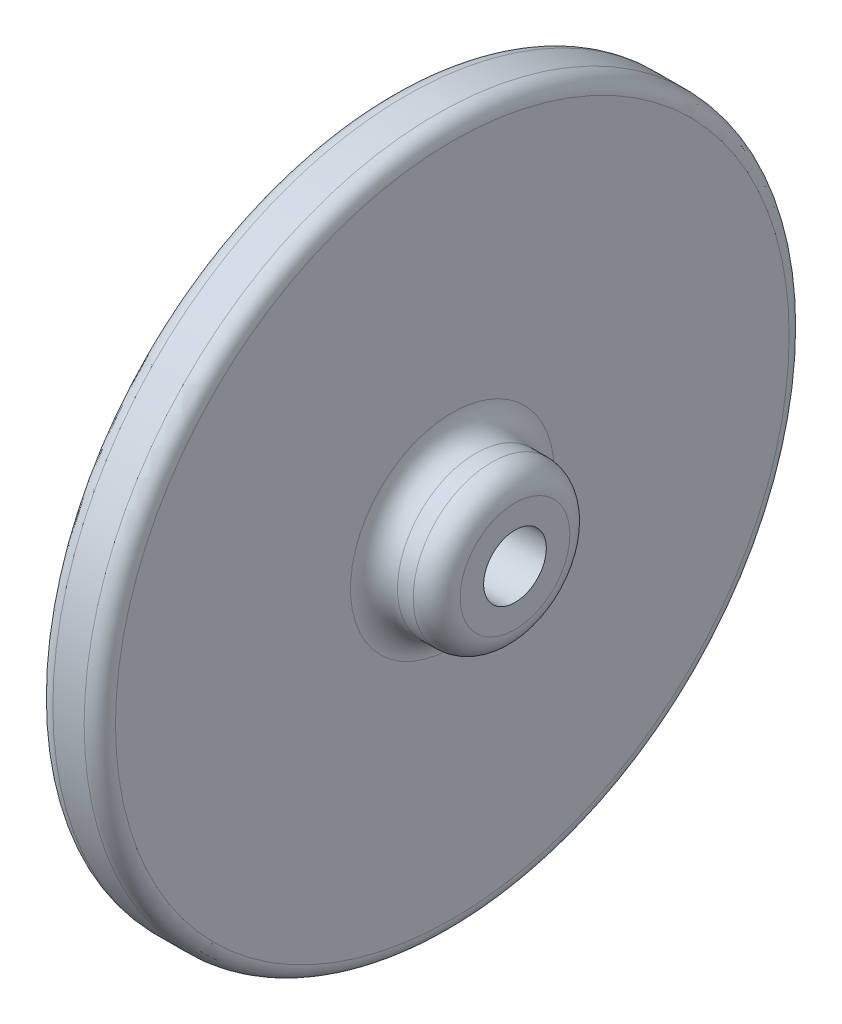
ISO-10303-21;
HEADER;
FILE_DESCRIPTION(('STEP AP214'),'2;1');
FILE_NAME('part.step','',(''),(''),'','','');
FILE_SCHEMA(('AUTOMOTIVE_DESIGN { 1 0 10303 214 1 1 1 1 }'));
ENDSEC;
DATA;
#1=APPLICATION_CONTEXT('core data for automotive mechanical design processes');
#2=APPLICATION_PROTOCOL_DEFINITION('international standard','automotive_design',2000,#1);
#3=PRODUCT_CONTEXT('',#1,'mechanical');
#4=PRODUCT('Part','Part','',(#3));
#5=PRODUCT_RELATED_PRODUCT_CATEGORY('part','',(#4));
#6=PRODUCT_DEFINITION_FORMATION('','',#4);
#7=PRODUCT_DEFINITION_CONTEXT('part definition',#1,'design');
#8=PRODUCT_DEFINITION('design','',#6,#7);
#9=PRODUCT_DEFINITION_SHAPE('','',#8);
#10=(LENGTH_UNIT() NAMED_UNIT(*) SI_UNIT(.MILLI.,.METRE.));
#11=(NAMED_UNIT(*) PLANE_ANGLE_UNIT() SI_UNIT($,.RADIAN.));
#12=(NAMED_UNIT(*) SI_UNIT($,.STERADIAN.) SOLID_ANGLE_UNIT());
#13=UNCERTAINTY_MEASURE_WITH_UNIT(LENGTH_MEASURE(1.E-05),#10,'distance_accuracy_value','');
#14=(GEOMETRIC_REPRESENTATION_CONTEXT(3) GLOBAL_UNCERTAINTY_ASSIGNED_CONTEXT((#13)) GLOBAL_UNIT_ASSIGNED_CONTEXT((#10,
#11,#12)) REPRESENTATION_CONTEXT('',''));
#15=CARTESIAN_POINT('',(0.,0.,0.));
#16=DIRECTION('',(0.,0.,1.));
#17=DIRECTION('',(1.,0.,0.));
#18=AXIS2_PLACEMENT_3D('',#15,#16,#17);
#19=CARTESIAN_POINT('',(8.,0.,0.));
#20=DIRECTION('',(-1.,0.,0.));
#21=DIRECTION('',(0.,0.,1.));
#22=AXIS2_PLACEMENT_3D('',#19,#20,#21);
#23=CYLINDRICAL_SURFACE('',#22,45.);
#24=CARTESIAN_POINT('',(6.,0.,0.));
#25=DIRECTION('',(1.,0.,0.));
#26=DIRECTION('',(0.,0.,-1.));
#27=AXIS2_PLACEMENT_3D('',#24,#25,#26);
#28=CIRCLE('',#27,45.);
#29=CARTESIAN_POINT('',(6.,0.,-45.));
#30=VERTEX_POINT('',#29);
#31=EDGE_CURVE('E83',#30,#30,#28,.F.);
#32=ORIENTED_EDGE('',*,*,#31,.T.);
#33=EDGE_LOOP('',(#32));
#34=FACE_BOUND('',#33,.T.);
#35=CARTESIAN_POINT('',(2.,0.,0.));
#36=DIRECTION('',(1.,0.,0.));
#37=DIRECTION('',(0.,0.,-1.));
#38=AXIS2_PLACEMENT_3D('',#35,#36,#37);
#39=CIRCLE('',#38,45.);
#40=CARTESIAN_POINT('',(2.,0.,-45.));
#41=VERTEX_POINT('',#40);
#42=EDGE_CURVE('E87',#41,#41,#39,.T.);
#43=ORIENTED_EDGE('',*,*,#42,.T.);
#44=EDGE_LOOP('',(#43));
#45=FACE_BOUND('',#44,.T.);
#46=ADVANCED_FACE('F37',(#34,#45),#23,.T.);
#47=CARTESIAN_POINT('',(8.,0.,0.));
#48=DIRECTION('',(1.,0.,0.));
#49=DIRECTION('',(0.,0.,-1.));
#50=AXIS2_PLACEMENT_3D('',#47,#48,#49);
#51=PLANE('',#50);
#52=CARTESIAN_POINT('',(8.,0.,0.));
#53=DIRECTION('',(1.,0.,0.));
#54=DIRECTION('',(0.,0.,-1.));
#55=AXIS2_PLACEMENT_3D('',#52,#53,#54);
#56=CIRCLE('',#55,13.);
#57=CARTESIAN_POINT('',(8.,0.,-13.));
#58=VERTEX_POINT('',#57);
#59=EDGE_CURVE('E68',#58,#58,#56,.F.);
#60=ORIENTED_EDGE('',*,*,#59,.T.);
#61=EDGE_LOOP('',(#60));
#62=FACE_BOUND('',#61,.T.);
#63=CARTESIAN_POINT('',(8.,0.,0.));
#64=DIRECTION('',(1.,0.,0.));
#65=DIRECTION('',(0.,0.,-1.));
#66=AXIS2_PLACEMENT_3D('',#63,#64,#65);
#67=CIRCLE('',#66,43.);
#68=CARTESIAN_POINT('',(8.,0.,-43.));
#69=VERTEX_POINT('',#68);
#70=EDGE_CURVE('E91',#69,#69,#67,.T.);
#71=ORIENTED_EDGE('',*,*,#70,.T.);
#72=EDGE_LOOP('',(#71));
#73=FACE_BOUND('',#72,.T.);
#74=ADVANCED_FACE('F115',(#62,#73),#51,.T.);
#75=CARTESIAN_POINT('',(0.,0.,0.));
#76=DIRECTION('',(1.,0.,0.));
#77=DIRECTION('',(0.,0.,-1.));
#78=AXIS2_PLACEMENT_3D('',#75,#76,#77);
#79=PLANE('',#78);
#80=CARTESIAN_POINT('',(0.,0.,0.));
#81=DIRECTION('',(1.,0.,0.));
#82=DIRECTION('',(0.,0.,-1.));
#83=AXIS2_PLACEMENT_3D('',#80,#81,#82);
#84=CIRCLE('',#83,13.);
#85=CARTESIAN_POINT('',(0.,0.,-13.));
#86=VERTEX_POINT('',#85);
#87=EDGE_CURVE('E45',#86,#86,#84,.T.);
#88=ORIENTED_EDGE('',*,*,#87,.T.);
#89=EDGE_LOOP('',(#88));
#90=FACE_BOUND('',#89,.T.);
#91=CARTESIAN_POINT('',(0.,0.,0.));
#92=DIRECTION('',(1.,0.,0.));
#93=DIRECTION('',(0.,0.,-1.));
#94=AXIS2_PLACEMENT_3D('',#91,#92,#93);
#95=CIRCLE('',#94,43.);
#96=CARTESIAN_POINT('',(0.,0.,-43.));
#97=VERTEX_POINT('',#96);
#98=EDGE_CURVE('E79',#97,#97,#95,.F.);
#99=ORIENTED_EDGE('',*,*,#98,.T.);
#100=EDGE_LOOP('',(#99));
#101=FACE_BOUND('',#100,.T.);
#102=ADVANCED_FACE('F121',(#90,#101),#79,.F.);
#103=CARTESIAN_POINT('',(16.,0.,0.));
#104=DIRECTION('',(-1.,0.,0.));
#105=DIRECTION('',(0.,0.,1.));
#106=AXIS2_PLACEMENT_3D('',#103,#104,#105);
#107=CYLINDRICAL_SURFACE('',#106,10.);
#108=CARTESIAN_POINT('',(11.,0.,0.));
#109=DIRECTION('',(1.,0.,0.));
#110=DIRECTION('',(0.,0.,-1.));
#111=AXIS2_PLACEMENT_3D('',#108,#109,#110);
#112=CIRCLE('',#111,10.);
#113=CARTESIAN_POINT('',(11.,0.,-10.));
#114=VERTEX_POINT('',#113);
#115=EDGE_CURVE('E71',#114,#114,#112,.T.);
#116=ORIENTED_EDGE('',*,*,#115,.T.);
#117=EDGE_LOOP('',(#116));
#118=FACE_BOUND('',#117,.T.);
#119=CARTESIAN_POINT('',(13.,0.,0.));
#120=DIRECTION('',(1.,0.,0.));
#121=DIRECTION('',(0.,0.,-1.));
#122=AXIS2_PLACEMENT_3D('',#119,#120,#121);
#123=CIRCLE('',#122,10.);
#124=CARTESIAN_POINT('',(13.,0.,-10.));
#125=VERTEX_POINT('',#124);
#126=EDGE_CURVE('E75',#125,#125,#123,.F.);
#127=ORIENTED_EDGE('',*,*,#126,.T.);
#128=EDGE_LOOP('',(#127));
#129=FACE_BOUND('',#128,.T.);
#130=ADVANCED_FACE('F162',(#118,#129),#107,.T.);
#131=CARTESIAN_POINT('',(16.,0.,0.));
#132=DIRECTION('',(1.,0.,0.));
#133=DIRECTION('',(0.,0.,-1.));
#134=AXIS2_PLACEMENT_3D('',#131,#132,#133);
#135=PLANE('',#134);
#136=CARTESIAN_POINT('',(16.,0.,0.));
#137=DIRECTION('',(1.,0.,0.));
#138=DIRECTION('',(0.,0.,-1.));
#139=AXIS2_PLACEMENT_3D('',#136,#137,#138);
#140=CIRCLE('',#139,4.);
#141=CARTESIAN_POINT('',(16.,0.,-4.));
#142=VERTEX_POINT('',#141);
#143=EDGE_CURVE('E94',#142,#142,#140,.T.);
#144=ORIENTED_EDGE('',*,*,#143,.F.);
#145=EDGE_LOOP('',(#144));
#146=FACE_BOUND('',#145,.T.);
#147=CARTESIAN_POINT('',(16.,0.,0.));
#148=DIRECTION('',(1.,0.,0.));
#149=DIRECTION('',(0.,0.,-1.));
#150=AXIS2_PLACEMENT_3D('',#147,#148,#149);
#151=CIRCLE('',#150,7.);
#152=CARTESIAN_POINT('',(16.,0.,-7.));
#153=VERTEX_POINT('',#152);
#154=EDGE_CURVE('E64',#153,#153,#151,.T.);
#155=ORIENTED_EDGE('',*,*,#154,.T.);
#156=EDGE_LOOP('',(#155));
#157=FACE_BOUND('',#156,.T.);
#158=ADVANCED_FACE('F131',(#146,#157),#135,.T.);
#159=CARTESIAN_POINT('',(6.,0.,0.));
#160=DIRECTION('',(1.,0.,0.));
#161=DIRECTION('',(0.,0.,-1.));
#162=AXIS2_PLACEMENT_3D('',#159,#160,#161);
#163=TOROIDAL_SURFACE('',#162,43.,2.);
#164=ORIENTED_EDGE('',*,*,#31,.F.);
#165=EDGE_LOOP('',(#164));
#166=FACE_BOUND('',#165,.T.);
#167=ORIENTED_EDGE('',*,*,#70,.F.);
#168=EDGE_LOOP('',(#167));
#169=FACE_BOUND('',#168,.T.);
#170=ADVANCED_FACE('F127',(#166,#169),#163,.T.);
#171=CARTESIAN_POINT('',(2.,0.,0.));
#172=DIRECTION('',(1.,0.,0.));
#173=DIRECTION('',(0.,0.,-1.));
#174=AXIS2_PLACEMENT_3D('',#171,#172,#173);
#175=TOROIDAL_SURFACE('',#174,43.,2.);
#176=ORIENTED_EDGE('',*,*,#98,.F.);
#177=EDGE_LOOP('',(#176));
#178=FACE_BOUND('',#177,.T.);
#179=ORIENTED_EDGE('',*,*,#42,.F.);
#180=EDGE_LOOP('',(#179));
#181=FACE_BOUND('',#180,.T.);
#182=ADVANCED_FACE('F130',(#178,#181),#175,.T.);
#183=CARTESIAN_POINT('',(11.,0.,0.));
#184=DIRECTION('',(1.,0.,0.));
#185=DIRECTION('',(0.,0.,-1.));
#186=AXIS2_PLACEMENT_3D('',#183,#184,#185);
#187=TOROIDAL_SURFACE('',#186,13.,3.);
#188=ORIENTED_EDGE('',*,*,#59,.F.);
#189=EDGE_LOOP('',(#188));
#190=FACE_BOUND('',#189,.T.);
#191=ORIENTED_EDGE('',*,*,#115,.F.);
#192=EDGE_LOOP('',(#191));
#193=FACE_BOUND('',#192,.T.);
#194=ADVANCED_FACE('F135',(#190,#193),#187,.F.);
#195=CARTESIAN_POINT('',(13.,0.,0.));
#196=DIRECTION('',(1.,0.,0.));
#197=DIRECTION('',(0.,0.,-1.));
#198=AXIS2_PLACEMENT_3D('',#195,#196,#197);
#199=TOROIDAL_SURFACE('',#198,7.,3.);
#200=ORIENTED_EDGE('',*,*,#126,.F.);
#201=EDGE_LOOP('',(#200));
#202=FACE_BOUND('',#201,.T.);
#203=ORIENTED_EDGE('',*,*,#154,.F.);
#204=EDGE_LOOP('',(#203));
#205=FACE_BOUND('',#204,.T.);
#206=ADVANCED_FACE('F139',(#202,#205),#199,.T.);
#207=CARTESIAN_POINT('',(-8.,0.,0.));
#208=DIRECTION('',(1.,0.,0.));
#209=DIRECTION('',(0.,0.,-1.));
#210=AXIS2_PLACEMENT_3D('',#207,#208,#209);
#211=CYLINDRICAL_SURFACE('',#210,10.);
#212=CARTESIAN_POINT('',(-3.,0.,0.));
#213=DIRECTION('',(1.,0.,0.));
#214=DIRECTION('',(0.,0.,-1.));
#215=AXIS2_PLACEMENT_3D('',#212,#213,#214);
#216=CIRCLE('',#215,10.);
#217=CARTESIAN_POINT('',(-3.,0.,-10.));
#218=VERTEX_POINT('',#217);
#219=EDGE_CURVE('E52',#218,#218,#216,.F.);
#220=ORIENTED_EDGE('',*,*,#219,.T.);
#221=EDGE_LOOP('',(#220));
#222=FACE_BOUND('',#221,.T.);
#223=CARTESIAN_POINT('',(-5.,0.,0.));
#224=DIRECTION('',(-1.,0.,0.));
#225=DIRECTION('',(0.,0.,1.));
#226=AXIS2_PLACEMENT_3D('',#223,#224,#225);
#227=CIRCLE('',#226,10.);
#228=CARTESIAN_POINT('',(-5.,0.,10.));
#229=VERTEX_POINT('',#228);
#230=EDGE_CURVE('E58',#229,#229,#227,.F.);
#231=ORIENTED_EDGE('',*,*,#230,.T.);
#232=EDGE_LOOP('',(#231));
#233=FACE_BOUND('',#232,.T.);
#234=ADVANCED_FACE('F142',(#222,#233),#211,.T.);
#235=CARTESIAN_POINT('',(-8.,0.,0.));
#236=DIRECTION('',(-1.,0.,0.));
#237=DIRECTION('',(0.,0.,1.));
#238=AXIS2_PLACEMENT_3D('',#235,#236,#237);
#239=PLANE('',#238);
#240=CARTESIAN_POINT('',(-8.,0.,0.));
#241=DIRECTION('',(1.,0.,0.));
#242=DIRECTION('',(0.,0.,-1.));
#243=AXIS2_PLACEMENT_3D('',#240,#241,#242);
#244=CIRCLE('',#243,4.);
#245=CARTESIAN_POINT('',(-8.,0.,-4.));
#246=VERTEX_POINT('',#245);
#247=EDGE_CURVE('E98',#246,#246,#244,.T.);
#248=ORIENTED_EDGE('',*,*,#247,.T.);
#249=EDGE_LOOP('',(#248));
#250=FACE_BOUND('',#249,.T.);
#251=CARTESIAN_POINT('',(-8.,0.,0.));
#252=DIRECTION('',(-1.,0.,0.));
#253=DIRECTION('',(0.,0.,1.));
#254=AXIS2_PLACEMENT_3D('',#251,#252,#253);
#255=CIRCLE('',#254,7.);
#256=CARTESIAN_POINT('',(-8.,0.,7.));
#257=VERTEX_POINT('',#256);
#258=EDGE_CURVE('E10',#257,#257,#255,.T.);
#259=ORIENTED_EDGE('',*,*,#258,.T.);
#260=EDGE_LOOP('',(#259));
#261=FACE_BOUND('',#260,.T.);
#262=ADVANCED_FACE('F102',(#250,#261),#239,.T.);
#263=CARTESIAN_POINT('',(-3.,0.,0.));
#264=DIRECTION('',(1.,0.,0.));
#265=DIRECTION('',(0.,0.,-1.));
#266=AXIS2_PLACEMENT_3D('',#263,#264,#265);
#267=TOROIDAL_SURFACE('',#266,13.,3.);
#268=ORIENTED_EDGE('',*,*,#87,.F.);
#269=EDGE_LOOP('',(#268));
#270=FACE_BOUND('',#269,.T.);
#271=ORIENTED_EDGE('',*,*,#219,.F.);
#272=EDGE_LOOP('',(#271));
#273=FACE_BOUND('',#272,.T.);
#274=ADVANCED_FACE('F111',(#270,#273),#267,.F.);
#275=CARTESIAN_POINT('',(-5.,0.,0.));
#276=DIRECTION('',(-1.,0.,0.));
#277=DIRECTION('',(0.,0.,1.));
#278=AXIS2_PLACEMENT_3D('',#275,#276,#277);
#279=TOROIDAL_SURFACE('',#278,7.,3.);
#280=ORIENTED_EDGE('',*,*,#230,.F.);
#281=EDGE_LOOP('',(#280));
#282=FACE_BOUND('',#281,.T.);
#283=ORIENTED_EDGE('',*,*,#258,.F.);
#284=EDGE_LOOP('',(#283));
#285=FACE_BOUND('',#284,.T.);
#286=ADVANCED_FACE('F39',(#282,#285),#279,.T.);
#287=CARTESIAN_POINT('',(16.,0.,0.));
#288=DIRECTION('',(-1.,0.,0.));
#289=DIRECTION('',(0.,0.,1.));
#290=AXIS2_PLACEMENT_3D('',#287,#288,#289);
#291=CYLINDRICAL_SURFACE('',#290,4.);
#292=ORIENTED_EDGE('',*,*,#143,.T.);
#293=EDGE_LOOP('',(#292));
#294=FACE_BOUND('',#293,.T.);
#295=ORIENTED_EDGE('',*,*,#247,.F.);
#296=EDGE_LOOP('',(#295));
#297=FACE_BOUND('',#296,.T.);
#298=ADVANCED_FACE('F104',(#294,#297),#291,.F.);
#299=CLOSED_SHELL('',(#46,#74,#102,#130,#158,#170,#182,#194,#206,#234,#262,#274,#286,#298));
#300=MANIFOLD_SOLID_BREP('B2',#299);
#301=ADVANCED_BREP_SHAPE_REPRESENTATION('',(#18,#300),#14);
#302=SHAPE_DEFINITION_REPRESENTATION(#9,#301);
ENDSEC;
END-ISO-10303-21;
